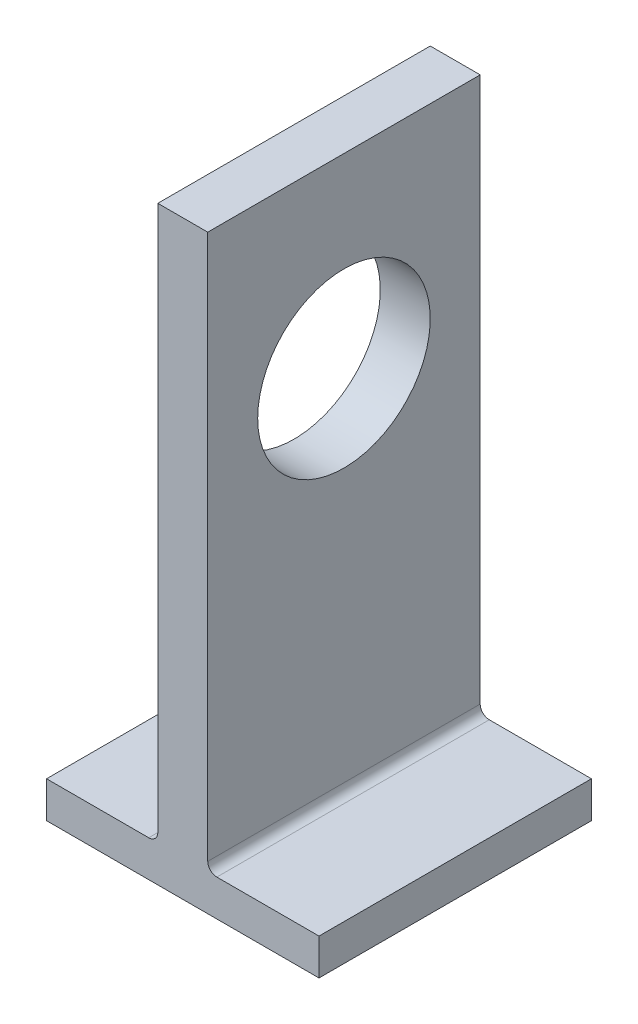
ISO-10303-21;
HEADER;
FILE_DESCRIPTION(('STEP AP214'),'2;1');
FILE_NAME('part.step','',(''),(''),'','','');
FILE_SCHEMA(('AUTOMOTIVE_DESIGN { 1 0 10303 214 1 1 1 1 }'));
ENDSEC;
DATA;
#1=APPLICATION_CONTEXT('core data for automotive mechanical design processes');
#2=APPLICATION_PROTOCOL_DEFINITION('international standard','automotive_design',2000,#1);
#3=PRODUCT_CONTEXT('',#1,'mechanical');
#4=PRODUCT('Part','Part','',(#3));
#5=PRODUCT_RELATED_PRODUCT_CATEGORY('part','',(#4));
#6=PRODUCT_DEFINITION_FORMATION('','',#4);
#7=PRODUCT_DEFINITION_CONTEXT('part definition',#1,'design');
#8=PRODUCT_DEFINITION('design','',#6,#7);
#9=PRODUCT_DEFINITION_SHAPE('','',#8);
#10=(LENGTH_UNIT() NAMED_UNIT(*) SI_UNIT(.MILLI.,.METRE.));
#11=(NAMED_UNIT(*) PLANE_ANGLE_UNIT() SI_UNIT($,.RADIAN.));
#12=(NAMED_UNIT(*) SI_UNIT($,.STERADIAN.) SOLID_ANGLE_UNIT());
#13=UNCERTAINTY_MEASURE_WITH_UNIT(LENGTH_MEASURE(1.E-05),#10,'distance_accuracy_value','');
#14=(GEOMETRIC_REPRESENTATION_CONTEXT(3) GLOBAL_UNCERTAINTY_ASSIGNED_CONTEXT((#13)) GLOBAL_UNIT_ASSIGNED_CONTEXT((#10,
#11,#12)) REPRESENTATION_CONTEXT('',''));
#15=CARTESIAN_POINT('',(0.,0.,0.));
#16=DIRECTION('',(0.,0.,1.));
#17=DIRECTION('',(1.,0.,0.));
#18=AXIS2_PLACEMENT_3D('',#15,#16,#17);
#19=CARTESIAN_POINT('',(-15.,0.,30.));
#20=DIRECTION('',(1.,0.,0.));
#21=DIRECTION('',(0.,0.,-1.));
#22=AXIS2_PLACEMENT_3D('',#19,#20,#21);
#23=PLANE('',#22);
#24=DIRECTION('',(0.,-1.,0.));
#25=VECTOR('',#24,1.);
#26=CARTESIAN_POINT('',(-15.,0.,0.));
#27=LINE('',#26,#25);
#28=CARTESIAN_POINT('',(-15.,0.,0.));
#29=VERTEX_POINT('',#28);
#30=CARTESIAN_POINT('',(-15.,-4.,0.));
#31=VERTEX_POINT('',#30);
#32=EDGE_CURVE('E141',#29,#31,#27,.T.);
#33=ORIENTED_EDGE('',*,*,#32,.T.);
#34=DIRECTION('',(0.,0.,-1.));
#35=VECTOR('',#34,1.);
#36=CARTESIAN_POINT('',(-15.,-4.,30.));
#37=LINE('',#36,#35);
#38=CARTESIAN_POINT('',(-15.,-4.,30.));
#39=VERTEX_POINT('',#38);
#40=EDGE_CURVE('E11',#39,#31,#37,.T.);
#41=ORIENTED_EDGE('',*,*,#40,.F.);
#42=DIRECTION('',(0.,-1.,0.));
#43=VECTOR('',#42,1.);
#44=CARTESIAN_POINT('',(-15.,0.,30.));
#45=LINE('',#44,#43);
#46=CARTESIAN_POINT('',(-15.,0.,30.));
#47=VERTEX_POINT('',#46);
#48=EDGE_CURVE('E160',#47,#39,#45,.T.);
#49=ORIENTED_EDGE('',*,*,#48,.F.);
#50=DIRECTION('',(0.,0.,-1.));
#51=VECTOR('',#50,1.);
#52=CARTESIAN_POINT('',(-15.,0.,30.));
#53=LINE('',#52,#51);
#54=EDGE_CURVE('E137',#47,#29,#53,.T.);
#55=ORIENTED_EDGE('',*,*,#54,.T.);
#56=EDGE_LOOP('',(#33,#41,#49,#55));
#57=FACE_BOUND('',#56,.T.);
#58=ADVANCED_FACE('F33',(#57),#23,.F.);
#59=CARTESIAN_POINT('',(-15.,-4.,30.));
#60=DIRECTION('',(0.,1.,0.));
#61=DIRECTION('',(-1.,0.,0.));
#62=AXIS2_PLACEMENT_3D('',#59,#60,#61);
#63=PLANE('',#62);
#64=DIRECTION('',(1.,0.,0.));
#65=VECTOR('',#64,1.);
#66=CARTESIAN_POINT('',(-15.,-4.,0.));
#67=LINE('',#66,#65);
#68=CARTESIAN_POINT('',(15.,-4.00000000000001,0.));
#69=VERTEX_POINT('',#68);
#70=EDGE_CURVE('E144',#31,#69,#67,.T.);
#71=ORIENTED_EDGE('',*,*,#70,.T.);
#72=DIRECTION('',(0.,0.,-1.));
#73=VECTOR('',#72,1.);
#74=CARTESIAN_POINT('',(15.,-4.00000000000001,30.));
#75=LINE('',#74,#73);
#76=CARTESIAN_POINT('',(15.,-4.00000000000001,30.));
#77=VERTEX_POINT('',#76);
#78=EDGE_CURVE('E41',#77,#69,#75,.T.);
#79=ORIENTED_EDGE('',*,*,#78,.F.);
#80=DIRECTION('',(1.,0.,0.));
#81=VECTOR('',#80,1.);
#82=CARTESIAN_POINT('',(-15.,-4.,30.));
#83=LINE('',#82,#81);
#84=EDGE_CURVE('E98',#39,#77,#83,.T.);
#85=ORIENTED_EDGE('',*,*,#84,.F.);
#86=ORIENTED_EDGE('',*,*,#40,.T.);
#87=EDGE_LOOP('',(#71,#79,#85,#86));
#88=FACE_BOUND('',#87,.T.);
#89=ADVANCED_FACE('F229',(#88),#63,.F.);
#90=CARTESIAN_POINT('',(15.,0.,30.));
#91=DIRECTION('',(-1.,0.,0.));
#92=DIRECTION('',(0.,0.,1.));
#93=AXIS2_PLACEMENT_3D('',#90,#91,#92);
#94=PLANE('',#93);
#95=DIRECTION('',(0.,1.,0.));
#96=VECTOR('',#95,1.);
#97=CARTESIAN_POINT('',(15.,0.,0.));
#98=LINE('',#97,#96);
#99=CARTESIAN_POINT('',(15.,0.,0.));
#100=VERTEX_POINT('',#99);
#101=EDGE_CURVE('E147',#69,#100,#98,.T.);
#102=ORIENTED_EDGE('',*,*,#101,.T.);
#103=DIRECTION('',(0.,0.,-1.));
#104=VECTOR('',#103,1.);
#105=CARTESIAN_POINT('',(15.,0.,30.));
#106=LINE('',#105,#104);
#107=CARTESIAN_POINT('',(15.,0.,30.));
#108=VERTEX_POINT('',#107);
#109=EDGE_CURVE('E173',#108,#100,#106,.T.);
#110=ORIENTED_EDGE('',*,*,#109,.F.);
#111=DIRECTION('',(0.,1.,0.));
#112=VECTOR('',#111,1.);
#113=CARTESIAN_POINT('',(15.,0.,30.));
#114=LINE('',#113,#112);
#115=EDGE_CURVE('E181',#77,#108,#114,.T.);
#116=ORIENTED_EDGE('',*,*,#115,.F.);
#117=ORIENTED_EDGE('',*,*,#78,.T.);
#118=EDGE_LOOP('',(#102,#110,#116,#117));
#119=FACE_BOUND('',#118,.T.);
#120=ADVANCED_FACE('F179',(#119),#94,.F.);
#121=CARTESIAN_POINT('',(3.75,0.,30.));
#122=DIRECTION('',(0.,-1.,0.));
#123=DIRECTION('',(1.,0.,0.));
#124=AXIS2_PLACEMENT_3D('',#121,#122,#123);
#125=PLANE('',#124);
#126=DIRECTION('',(-1.,0.,0.));
#127=VECTOR('',#126,1.);
#128=CARTESIAN_POINT('',(3.75,0.,0.));
#129=LINE('',#128,#127);
#130=CARTESIAN_POINT('',(3.75,0.,0.));
#131=VERTEX_POINT('',#130);
#132=EDGE_CURVE('E149',#100,#131,#129,.T.);
#133=ORIENTED_EDGE('',*,*,#132,.T.);
#134=DIRECTION('',(0.,0.,-1.));
#135=VECTOR('',#134,1.);
#136=CARTESIAN_POINT('',(3.75,0.,30.));
#137=LINE('',#136,#135);
#138=CARTESIAN_POINT('',(3.75,0.,30.));
#139=VERTEX_POINT('',#138);
#140=EDGE_CURVE('E170',#139,#131,#137,.T.);
#141=ORIENTED_EDGE('',*,*,#140,.F.);
#142=DIRECTION('',(-1.,0.,0.));
#143=VECTOR('',#142,1.);
#144=CARTESIAN_POINT('',(3.75,0.,30.));
#145=LINE('',#144,#143);
#146=EDGE_CURVE('E199',#108,#139,#145,.T.);
#147=ORIENTED_EDGE('',*,*,#146,.F.);
#148=ORIENTED_EDGE('',*,*,#109,.T.);
#149=EDGE_LOOP('',(#133,#141,#147,#148));
#150=FACE_BOUND('',#149,.T.);
#151=ADVANCED_FACE('F190',(#150),#125,.F.);
#152=CARTESIAN_POINT('',(3.75,0.999999999999995,30.));
#153=DIRECTION('',(0.,0.,-1.));
#154=DIRECTION('',(-1.,0.,0.));
#155=AXIS2_PLACEMENT_3D('',#152,#153,#154);
#156=CYLINDRICAL_SURFACE('',#155,1.);
#157=CARTESIAN_POINT('',(3.75,0.999999999999995,0.));
#158=DIRECTION('',(0.,0.,-1.));
#159=DIRECTION('',(-1.,0.,0.));
#160=AXIS2_PLACEMENT_3D('',#157,#158,#159);
#161=CIRCLE('',#160,1.);
#162=CARTESIAN_POINT('',(2.75,0.999999999999995,0.));
#163=VERTEX_POINT('',#162);
#164=EDGE_CURVE('E151',#131,#163,#161,.T.);
#165=ORIENTED_EDGE('',*,*,#164,.T.);
#166=DIRECTION('',(0.,0.,-1.));
#167=VECTOR('',#166,1.);
#168=CARTESIAN_POINT('',(2.75,0.999999999999995,30.));
#169=LINE('',#168,#167);
#170=CARTESIAN_POINT('',(2.75,0.999999999999995,30.));
#171=VERTEX_POINT('',#170);
#172=EDGE_CURVE('E167',#171,#163,#169,.T.);
#173=ORIENTED_EDGE('',*,*,#172,.F.);
#174=CARTESIAN_POINT('',(3.75,0.999999999999995,30.));
#175=DIRECTION('',(0.,0.,-1.));
#176=DIRECTION('',(-1.,0.,0.));
#177=AXIS2_PLACEMENT_3D('',#174,#175,#176);
#178=CIRCLE('',#177,1.);
#179=EDGE_CURVE('E196',#139,#171,#178,.T.);
#180=ORIENTED_EDGE('',*,*,#179,.F.);
#181=ORIENTED_EDGE('',*,*,#140,.T.);
#182=EDGE_LOOP('',(#165,#173,#180,#181));
#183=FACE_BOUND('',#182,.T.);
#184=ADVANCED_FACE('F194',(#183),#156,.F.);
#185=CARTESIAN_POINT('',(2.75,0.999999999999995,30.));
#186=DIRECTION('',(-1.,0.,0.));
#187=DIRECTION('',(0.,0.,1.));
#188=AXIS2_PLACEMENT_3D('',#185,#186,#187);
#189=PLANE('',#188);
#190=CARTESIAN_POINT('',(2.75,40.5,15.));
#191=DIRECTION('',(-1.,0.,0.));
#192=DIRECTION('',(0.,0.,1.));
#193=AXIS2_PLACEMENT_3D('',#190,#191,#192);
#194=CIRCLE('',#193,9.5);
#195=CARTESIAN_POINT('',(2.75,40.5,24.5));
#196=VERTEX_POINT('',#195);
#197=EDGE_CURVE('E145',#196,#196,#194,.T.);
#198=ORIENTED_EDGE('',*,*,#197,.T.);
#199=EDGE_LOOP('',(#198));
#200=FACE_BOUND('',#199,.T.);
#201=DIRECTION('',(0.,1.,0.));
#202=VECTOR('',#201,1.);
#203=CARTESIAN_POINT('',(2.75,0.999999999999995,0.));
#204=LINE('',#203,#202);
#205=CARTESIAN_POINT('',(2.75,61.,0.));
#206=VERTEX_POINT('',#205);
#207=EDGE_CURVE('E153',#163,#206,#204,.T.);
#208=ORIENTED_EDGE('',*,*,#207,.T.);
#209=DIRECTION('',(0.,0.,-1.));
#210=VECTOR('',#209,1.);
#211=CARTESIAN_POINT('',(2.75,61.,30.));
#212=LINE('',#211,#210);
#213=CARTESIAN_POINT('',(2.75,61.,30.));
#214=VERTEX_POINT('',#213);
#215=EDGE_CURVE('E164',#214,#206,#212,.T.);
#216=ORIENTED_EDGE('',*,*,#215,.F.);
#217=DIRECTION('',(0.,1.,0.));
#218=VECTOR('',#217,1.);
#219=CARTESIAN_POINT('',(2.75,0.999999999999995,30.));
#220=LINE('',#219,#218);
#221=EDGE_CURVE('E198',#171,#214,#220,.T.);
#222=ORIENTED_EDGE('',*,*,#221,.F.);
#223=ORIENTED_EDGE('',*,*,#172,.T.);
#224=EDGE_LOOP('',(#208,#216,#222,#223));
#225=FACE_BOUND('',#224,.T.);
#226=ADVANCED_FACE('F225',(#200,#225),#189,.F.);
#227=CARTESIAN_POINT('',(-2.75,61.,30.));
#228=DIRECTION('',(0.,-1.,0.));
#229=DIRECTION('',(0.,0.,-1.));
#230=AXIS2_PLACEMENT_3D('',#227,#228,#229);
#231=PLANE('',#230);
#232=DIRECTION('',(-1.,0.,0.));
#233=VECTOR('',#232,1.);
#234=CARTESIAN_POINT('',(-2.75,61.,0.));
#235=LINE('',#234,#233);
#236=CARTESIAN_POINT('',(-2.75,61.,0.));
#237=VERTEX_POINT('',#236);
#238=EDGE_CURVE('E155',#206,#237,#235,.T.);
#239=ORIENTED_EDGE('',*,*,#238,.T.);
#240=DIRECTION('',(0.,0.,-1.));
#241=VECTOR('',#240,1.);
#242=CARTESIAN_POINT('',(-2.75,61.,30.));
#243=LINE('',#242,#241);
#244=CARTESIAN_POINT('',(-2.75,61.,30.));
#245=VERTEX_POINT('',#244);
#246=EDGE_CURVE('E132',#245,#237,#243,.T.);
#247=ORIENTED_EDGE('',*,*,#246,.F.);
#248=DIRECTION('',(-1.,0.,0.));
#249=VECTOR('',#248,1.);
#250=CARTESIAN_POINT('',(-2.75,61.,30.));
#251=LINE('',#250,#249);
#252=EDGE_CURVE('E123',#214,#245,#251,.T.);
#253=ORIENTED_EDGE('',*,*,#252,.F.);
#254=ORIENTED_EDGE('',*,*,#215,.T.);
#255=EDGE_LOOP('',(#239,#247,#253,#254));
#256=FACE_BOUND('',#255,.T.);
#257=ADVANCED_FACE('F217',(#256),#231,.F.);
#258=CARTESIAN_POINT('',(-2.75,0.999999999999995,30.));
#259=DIRECTION('',(1.,0.,0.));
#260=DIRECTION('',(0.,0.,-1.));
#261=AXIS2_PLACEMENT_3D('',#258,#259,#260);
#262=PLANE('',#261);
#263=CARTESIAN_POINT('',(-2.75,40.5,15.));
#264=DIRECTION('',(-1.,0.,0.));
#265=DIRECTION('',(0.,0.,1.));
#266=AXIS2_PLACEMENT_3D('',#263,#264,#265);
#267=CIRCLE('',#266,9.5);
#268=CARTESIAN_POINT('',(-2.75,40.5,24.5));
#269=VERTEX_POINT('',#268);
#270=EDGE_CURVE('E209',#269,#269,#267,.T.);
#271=ORIENTED_EDGE('',*,*,#270,.F.);
#272=EDGE_LOOP('',(#271));
#273=FACE_BOUND('',#272,.T.);
#274=DIRECTION('',(0.,-1.,0.));
#275=VECTOR('',#274,1.);
#276=CARTESIAN_POINT('',(-2.75,0.999999999999995,0.));
#277=LINE('',#276,#275);
#278=CARTESIAN_POINT('',(-2.75,0.999999999999995,0.));
#279=VERTEX_POINT('',#278);
#280=EDGE_CURVE('E131',#237,#279,#277,.T.);
#281=ORIENTED_EDGE('',*,*,#280,.T.);
#282=DIRECTION('',(0.,0.,-1.));
#283=VECTOR('',#282,1.);
#284=CARTESIAN_POINT('',(-2.75,0.999999999999995,30.));
#285=LINE('',#284,#283);
#286=CARTESIAN_POINT('',(-2.75,0.999999999999995,30.));
#287=VERTEX_POINT('',#286);
#288=EDGE_CURVE('E128',#287,#279,#285,.T.);
#289=ORIENTED_EDGE('',*,*,#288,.F.);
#290=DIRECTION('',(0.,-1.,0.));
#291=VECTOR('',#290,1.);
#292=CARTESIAN_POINT('',(-2.75,0.999999999999995,30.));
#293=LINE('',#292,#291);
#294=EDGE_CURVE('E117',#245,#287,#293,.T.);
#295=ORIENTED_EDGE('',*,*,#294,.F.);
#296=ORIENTED_EDGE('',*,*,#246,.T.);
#297=EDGE_LOOP('',(#281,#289,#295,#296));
#298=FACE_BOUND('',#297,.T.);
#299=ADVANCED_FACE('F129',(#273,#298),#262,.F.);
#300=CARTESIAN_POINT('',(-3.75,0.999999999999995,30.));
#301=DIRECTION('',(0.,0.,-1.));
#302=DIRECTION('',(-1.,0.,0.));
#303=AXIS2_PLACEMENT_3D('',#300,#301,#302);
#304=CYLINDRICAL_SURFACE('',#303,1.);
#305=CARTESIAN_POINT('',(-3.75,0.999999999999995,0.));
#306=DIRECTION('',(0.,0.,-1.));
#307=DIRECTION('',(1.,0.,0.));
#308=AXIS2_PLACEMENT_3D('',#305,#306,#307);
#309=CIRCLE('',#308,1.);
#310=CARTESIAN_POINT('',(-3.75,0.,0.));
#311=VERTEX_POINT('',#310);
#312=EDGE_CURVE('E84',#279,#311,#309,.T.);
#313=ORIENTED_EDGE('',*,*,#312,.T.);
#314=DIRECTION('',(0.,0.,-1.));
#315=VECTOR('',#314,1.);
#316=CARTESIAN_POINT('',(-3.75,0.,30.));
#317=LINE('',#316,#315);
#318=CARTESIAN_POINT('',(-3.75,0.,30.));
#319=VERTEX_POINT('',#318);
#320=EDGE_CURVE('E133',#319,#311,#317,.T.);
#321=ORIENTED_EDGE('',*,*,#320,.F.);
#322=CARTESIAN_POINT('',(-3.75,0.999999999999995,30.));
#323=DIRECTION('',(0.,0.,-1.));
#324=DIRECTION('',(1.,0.,0.));
#325=AXIS2_PLACEMENT_3D('',#322,#323,#324);
#326=CIRCLE('',#325,1.);
#327=EDGE_CURVE('E121',#287,#319,#326,.T.);
#328=ORIENTED_EDGE('',*,*,#327,.F.);
#329=ORIENTED_EDGE('',*,*,#288,.T.);
#330=EDGE_LOOP('',(#313,#321,#328,#329));
#331=FACE_BOUND('',#330,.T.);
#332=ADVANCED_FACE('F135',(#331),#304,.F.);
#333=CARTESIAN_POINT('',(-15.,0.,30.));
#334=DIRECTION('',(0.,-1.,0.));
#335=DIRECTION('',(1.,0.,0.));
#336=AXIS2_PLACEMENT_3D('',#333,#334,#335);
#337=PLANE('',#336);
#338=DIRECTION('',(-1.,0.,0.));
#339=VECTOR('',#338,1.);
#340=CARTESIAN_POINT('',(-15.,0.,0.));
#341=LINE('',#340,#339);
#342=EDGE_CURVE('E90',#311,#29,#341,.T.);
#343=ORIENTED_EDGE('',*,*,#342,.T.);
#344=ORIENTED_EDGE('',*,*,#54,.F.);
#345=DIRECTION('',(-1.,0.,0.));
#346=VECTOR('',#345,1.);
#347=CARTESIAN_POINT('',(-15.,0.,30.));
#348=LINE('',#347,#346);
#349=EDGE_CURVE('E49',#319,#47,#348,.T.);
#350=ORIENTED_EDGE('',*,*,#349,.F.);
#351=ORIENTED_EDGE('',*,*,#320,.T.);
#352=EDGE_LOOP('',(#343,#344,#350,#351));
#353=FACE_BOUND('',#352,.T.);
#354=ADVANCED_FACE('F223',(#353),#337,.F.);
#355=CARTESIAN_POINT('',(3.75,0.999999999999995,30.));
#356=DIRECTION('',(0.,0.,-1.));
#357=DIRECTION('',(-1.,0.,0.));
#358=AXIS2_PLACEMENT_3D('',#355,#356,#357);
#359=PLANE('',#358);
#360=ORIENTED_EDGE('',*,*,#48,.T.);
#361=ORIENTED_EDGE('',*,*,#84,.T.);
#362=ORIENTED_EDGE('',*,*,#115,.T.);
#363=ORIENTED_EDGE('',*,*,#146,.T.);
#364=ORIENTED_EDGE('',*,*,#179,.T.);
#365=ORIENTED_EDGE('',*,*,#221,.T.);
#366=ORIENTED_EDGE('',*,*,#252,.T.);
#367=ORIENTED_EDGE('',*,*,#294,.T.);
#368=ORIENTED_EDGE('',*,*,#327,.T.);
#369=ORIENTED_EDGE('',*,*,#349,.T.);
#370=EDGE_LOOP('',(#360,#361,#362,#363,#364,#365,#366,#367,#368,#369));
#371=FACE_BOUND('',#370,.T.);
#372=ADVANCED_FACE('F119',(#371),#359,.F.);
#373=CARTESIAN_POINT('',(3.75,0.999999999999995,0.));
#374=DIRECTION('',(0.,0.,-1.));
#375=DIRECTION('',(-1.,0.,0.));
#376=AXIS2_PLACEMENT_3D('',#373,#374,#375);
#377=PLANE('',#376);
#378=ORIENTED_EDGE('',*,*,#32,.F.);
#379=ORIENTED_EDGE('',*,*,#342,.F.);
#380=ORIENTED_EDGE('',*,*,#312,.F.);
#381=ORIENTED_EDGE('',*,*,#280,.F.);
#382=ORIENTED_EDGE('',*,*,#238,.F.);
#383=ORIENTED_EDGE('',*,*,#207,.F.);
#384=ORIENTED_EDGE('',*,*,#164,.F.);
#385=ORIENTED_EDGE('',*,*,#132,.F.);
#386=ORIENTED_EDGE('',*,*,#101,.F.);
#387=ORIENTED_EDGE('',*,*,#70,.F.);
#388=EDGE_LOOP('',(#378,#379,#380,#381,#382,#383,#384,#385,#386,#387));
#389=FACE_BOUND('',#388,.T.);
#390=ADVANCED_FACE('F185',(#389),#377,.T.);
#391=CARTESIAN_POINT('',(67.25,40.5,15.));
#392=DIRECTION('',(-1.,0.,0.));
#393=DIRECTION('',(0.,0.,1.));
#394=AXIS2_PLACEMENT_3D('',#391,#392,#393);
#395=CYLINDRICAL_SURFACE('',#394,9.5);
#396=ORIENTED_EDGE('',*,*,#270,.T.);
#397=EDGE_LOOP('',(#396));
#398=FACE_BOUND('',#397,.T.);
#399=ORIENTED_EDGE('',*,*,#197,.F.);
#400=EDGE_LOOP('',(#399));
#401=FACE_BOUND('',#400,.T.);
#402=ADVANCED_FACE('F213',(#398,#401),#395,.F.);
#403=CLOSED_SHELL('',(#58,#89,#120,#151,#184,#226,#257,#299,#332,#354,#372,#390,#402));
#404=MANIFOLD_SOLID_BREP('B2',#403);
#405=ADVANCED_BREP_SHAPE_REPRESENTATION('',(#18,#404),#14);
#406=SHAPE_DEFINITION_REPRESENTATION(#9,#405);
ENDSEC;
END-ISO-10303-21;
